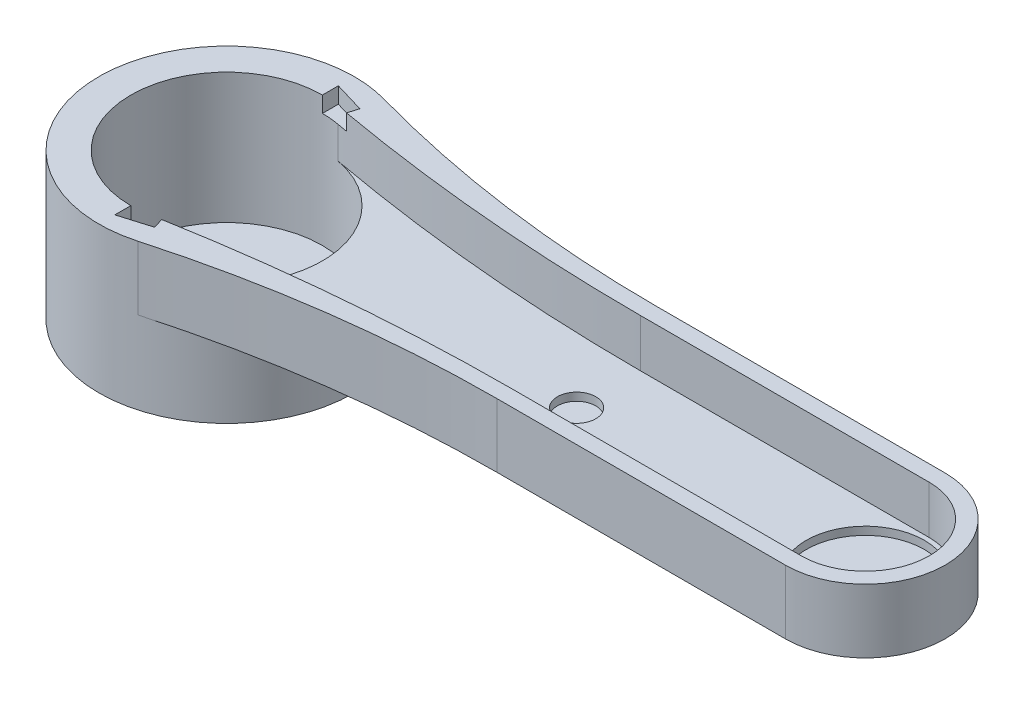
ISO-10303-21;
HEADER;
FILE_DESCRIPTION(('STEP AP214'),'2;1');
FILE_NAME('part.step','',(''),(''),'','','');
FILE_SCHEMA(('AUTOMOTIVE_DESIGN { 1 0 10303 214 1 1 1 1 }'));
ENDSEC;
DATA;
#1=APPLICATION_CONTEXT('core data for automotive mechanical design processes');
#2=APPLICATION_PROTOCOL_DEFINITION('international standard','automotive_design',2000,#1);
#3=PRODUCT_CONTEXT('',#1,'mechanical');
#4=PRODUCT('Part','Part','',(#3));
#5=PRODUCT_RELATED_PRODUCT_CATEGORY('part','',(#4));
#6=PRODUCT_DEFINITION_FORMATION('','',#4);
#7=PRODUCT_DEFINITION_CONTEXT('part definition',#1,'design');
#8=PRODUCT_DEFINITION('design','',#6,#7);
#9=PRODUCT_DEFINITION_SHAPE('','',#8);
#10=(LENGTH_UNIT() NAMED_UNIT(*) SI_UNIT(.MILLI.,.METRE.));
#11=(NAMED_UNIT(*) PLANE_ANGLE_UNIT() SI_UNIT($,.RADIAN.));
#12=(NAMED_UNIT(*) SI_UNIT($,.STERADIAN.) SOLID_ANGLE_UNIT());
#13=UNCERTAINTY_MEASURE_WITH_UNIT(LENGTH_MEASURE(1.E-05),#10,'distance_accuracy_value','');
#14=(GEOMETRIC_REPRESENTATION_CONTEXT(3) GLOBAL_UNCERTAINTY_ASSIGNED_CONTEXT((#13)) GLOBAL_UNIT_ASSIGNED_CONTEXT((#10,
#11,#12)) REPRESENTATION_CONTEXT('',''));
#15=CARTESIAN_POINT('',(0.,0.,0.));
#16=DIRECTION('',(0.,0.,1.));
#17=DIRECTION('',(1.,0.,0.));
#18=AXIS2_PLACEMENT_3D('',#15,#16,#17);
#19=CARTESIAN_POINT('',(0.,15.,0.));
#20=DIRECTION('',(0.,-1.,0.));
#21=DIRECTION('',(0.,0.,-1.));
#22=AXIS2_PLACEMENT_3D('',#19,#20,#21);
#23=CYLINDRICAL_SURFACE('',#22,30.);
#24=CARTESIAN_POINT('',(0.,-25.8,0.));
#25=DIRECTION('',(0.,-1.,0.));
#26=DIRECTION('',(0.,0.,-1.));
#27=AXIS2_PLACEMENT_3D('',#24,#25,#26);
#28=CIRCLE('',#27,30.);
#29=CARTESIAN_POINT('',(0.,-25.8,-30.));
#30=VERTEX_POINT('',#29);
#31=EDGE_CURVE('E281',#30,#30,#28,.T.);
#32=ORIENTED_EDGE('',*,*,#31,.T.);
#33=EDGE_LOOP('',(#32));
#34=FACE_BOUND('',#33,.T.);
#35=CARTESIAN_POINT('',(0.,10.,0.));
#36=DIRECTION('',(0.,1.,0.));
#37=DIRECTION('',(0.,0.,1.));
#38=AXIS2_PLACEMENT_3D('',#35,#36,#37);
#39=CIRCLE('',#38,30.);
#40=CARTESIAN_POINT('',(0.,10.,-30.));
#41=VERTEX_POINT('',#40);
#42=CARTESIAN_POINT('',(5.42925456731082,10.,-29.5046300577271));
#43=VERTEX_POINT('',#42);
#44=EDGE_CURVE('E192',#41,#43,#39,.F.);
#45=ORIENTED_EDGE('',*,*,#44,.F.);
#46=DIRECTION('',(0.,1.,0.));
#47=VECTOR('',#46,1.);
#48=CARTESIAN_POINT('',(0.,10.,-30.));
#49=LINE('',#48,#47);
#50=CARTESIAN_POINT('',(0.,15.,-30.));
#51=VERTEX_POINT('',#50);
#52=EDGE_CURVE('E176',#41,#51,#49,.T.);
#53=ORIENTED_EDGE('',*,*,#52,.T.);
#54=CARTESIAN_POINT('',(0.,15.,0.));
#55=DIRECTION('',(0.,1.,0.));
#56=DIRECTION('',(0.,0.,1.));
#57=AXIS2_PLACEMENT_3D('',#54,#55,#56);
#58=CIRCLE('',#57,30.);
#59=CARTESIAN_POINT('',(0.,15.,30.));
#60=VERTEX_POINT('',#59);
#61=EDGE_CURVE('E312',#51,#60,#58,.T.);
#62=ORIENTED_EDGE('',*,*,#61,.T.);
#63=DIRECTION('',(0.,1.,0.));
#64=VECTOR('',#63,1.);
#65=CARTESIAN_POINT('',(0.,10.,30.));
#66=LINE('',#65,#64);
#67=CARTESIAN_POINT('',(0.,10.,30.));
#68=VERTEX_POINT('',#67);
#69=EDGE_CURVE('E242',#68,#60,#66,.T.);
#70=ORIENTED_EDGE('',*,*,#69,.F.);
#71=CARTESIAN_POINT('',(0.,10.,0.));
#72=DIRECTION('',(0.,1.,0.));
#73=DIRECTION('',(0.,0.,1.));
#74=AXIS2_PLACEMENT_3D('',#71,#72,#73);
#75=CIRCLE('',#74,30.);
#76=CARTESIAN_POINT('',(5.42925456731086,10.,29.5046300577271));
#77=VERTEX_POINT('',#76);
#78=EDGE_CURVE('E228',#77,#68,#75,.F.);
#79=ORIENTED_EDGE('',*,*,#78,.F.);
#80=DIRECTION('',(0.,-1.,0.));
#81=VECTOR('',#80,1.);
#82=CARTESIAN_POINT('',(5.42925456731085,15.,29.5046300577271));
#83=LINE('',#82,#81);
#84=CARTESIAN_POINT('',(5.42925456731085,0.,29.5046300577271));
#85=VERTEX_POINT('',#84);
#86=EDGE_CURVE('E340',#77,#85,#83,.T.);
#87=ORIENTED_EDGE('',*,*,#86,.T.);
#88=CARTESIAN_POINT('',(0.,0.,0.));
#89=DIRECTION('',(0.,-1.,0.));
#90=DIRECTION('',(0.,0.,-1.));
#91=AXIS2_PLACEMENT_3D('',#88,#89,#90);
#92=CIRCLE('',#91,30.);
#93=CARTESIAN_POINT('',(5.42925456731085,0.,-29.5046300577271));
#94=VERTEX_POINT('',#93);
#95=EDGE_CURVE('E284',#94,#85,#92,.T.);
#96=ORIENTED_EDGE('',*,*,#95,.F.);
#97=DIRECTION('',(0.,-1.,0.));
#98=VECTOR('',#97,1.);
#99=CARTESIAN_POINT('',(5.42925456731085,15.,-29.5046300577271));
#100=LINE('',#99,#98);
#101=EDGE_CURVE('E199',#43,#94,#100,.T.);
#102=ORIENTED_EDGE('',*,*,#101,.F.);
#103=EDGE_LOOP('',(#45,#53,#62,#70,#79,#87,#96,#102));
#104=FACE_BOUND('',#103,.T.);
#105=ADVANCED_FACE('F37',(#34,#104),#23,.F.);
#106=CARTESIAN_POINT('',(109.6,15.,-595.608000000001));
#107=DIRECTION('',(0.,-1.,0.));
#108=DIRECTION('',(0.,0.,-1.));
#109=AXIS2_PLACEMENT_3D('',#106,#107,#108);
#110=CYLINDRICAL_SURFACE('',#109,575.608000000001);
#111=CARTESIAN_POINT('',(109.6,15.,-595.608000000001));
#112=DIRECTION('',(0.,1.,0.));
#113=DIRECTION('',(0.,0.,1.));
#114=AXIS2_PLACEMENT_3D('',#111,#112,#113);
#115=CIRCLE('',#114,575.608000000001);
#116=CARTESIAN_POINT('',(109.6,15.,-20.));
#117=VERTEX_POINT('',#116);
#118=CARTESIAN_POINT('',(8.62408159084349,15.,-28.9260490209456));
#119=VERTEX_POINT('',#118);
#120=EDGE_CURVE('E314',#117,#119,#115,.F.);
#121=ORIENTED_EDGE('',*,*,#120,.T.);
#122=DIRECTION('',(0.,1.,0.));
#123=VECTOR('',#122,1.);
#124=CARTESIAN_POINT('',(8.62408159084346,10.,-28.9260490209455));
#125=LINE('',#124,#123);
#126=CARTESIAN_POINT('',(8.62408159084346,10.,-28.9260490209455));
#127=VERTEX_POINT('',#126);
#128=EDGE_CURVE('E54',#127,#119,#125,.T.);
#129=ORIENTED_EDGE('',*,*,#128,.F.);
#130=CARTESIAN_POINT('',(109.6,10.,-595.608000000001));
#131=DIRECTION('',(0.,1.,0.));
#132=DIRECTION('',(0.,0.,1.));
#133=AXIS2_PLACEMENT_3D('',#130,#131,#132);
#134=CIRCLE('',#133,575.608000000001);
#135=EDGE_CURVE('E200',#43,#127,#134,.T.);
#136=ORIENTED_EDGE('',*,*,#135,.F.);
#137=ORIENTED_EDGE('',*,*,#101,.T.);
#138=CARTESIAN_POINT('',(109.6,0.,-595.608000000001));
#139=DIRECTION('',(0.,1.,0.));
#140=DIRECTION('',(0.,0.,1.));
#141=AXIS2_PLACEMENT_3D('',#138,#139,#140);
#142=CIRCLE('',#141,575.608000000001);
#143=CARTESIAN_POINT('',(109.6,0.,-20.));
#144=VERTEX_POINT('',#143);
#145=EDGE_CURVE('E329',#144,#94,#142,.F.);
#146=ORIENTED_EDGE('',*,*,#145,.F.);
#147=DIRECTION('',(0.,-1.,0.));
#148=VECTOR('',#147,1.);
#149=CARTESIAN_POINT('',(109.6,15.,-20.));
#150=LINE('',#149,#148);
#151=EDGE_CURVE('E336',#117,#144,#150,.T.);
#152=ORIENTED_EDGE('',*,*,#151,.F.);
#153=EDGE_LOOP('',(#121,#129,#136,#137,#146,#152));
#154=FACE_BOUND('',#153,.T.);
#155=ADVANCED_FACE('F405',(#154),#110,.T.);
#156=CARTESIAN_POINT('',(0.,15.,0.));
#157=DIRECTION('',(0.,1.,0.));
#158=DIRECTION('',(0.,0.,1.));
#159=AXIS2_PLACEMENT_3D('',#156,#157,#158);
#160=PLANE('',#159);
#161=DIRECTION('',(-1.,0.,0.));
#162=VECTOR('',#161,1.);
#163=CARTESIAN_POINT('',(0.,15.,25.));
#164=LINE('',#163,#162);
#165=CARTESIAN_POINT('',(200.,15.,25.));
#166=VERTEX_POINT('',#165);
#167=CARTESIAN_POINT('',(109.6,15.,25.));
#168=VERTEX_POINT('',#167);
#169=EDGE_CURVE('E288',#166,#168,#164,.T.);
#170=ORIENTED_EDGE('',*,*,#169,.F.);
#171=CARTESIAN_POINT('',(200.,15.,0.));
#172=DIRECTION('',(0.,1.,0.));
#173=DIRECTION('',(0.,0.,1.));
#174=AXIS2_PLACEMENT_3D('',#171,#172,#173);
#175=CIRCLE('',#174,25.);
#176=CARTESIAN_POINT('',(200.,15.,-25.));
#177=VERTEX_POINT('',#176);
#178=EDGE_CURVE('E291',#166,#177,#175,.T.);
#179=ORIENTED_EDGE('',*,*,#178,.T.);
#180=DIRECTION('',(-1.,0.,0.));
#181=VECTOR('',#180,1.);
#182=CARTESIAN_POINT('',(0.,15.,-25.));
#183=LINE('',#182,#181);
#184=CARTESIAN_POINT('',(109.6,15.,-25.));
#185=VERTEX_POINT('',#184);
#186=EDGE_CURVE('E294',#177,#185,#183,.T.);
#187=ORIENTED_EDGE('',*,*,#186,.T.);
#188=CARTESIAN_POINT('',(109.6,15.,-392.905333333334));
#189=DIRECTION('',(0.,1.,0.));
#190=DIRECTION('',(0.,0.,1.));
#191=AXIS2_PLACEMENT_3D('',#188,#189,#190);
#192=CIRCLE('',#191,367.905333333334);
#193=CARTESIAN_POINT('',(10.7475917614871,15.,-38.5290704705994));
#194=VERTEX_POINT('',#193);
#195=EDGE_CURVE('E296',#185,#194,#192,.F.);
#196=ORIENTED_EDGE('',*,*,#195,.T.);
#197=CARTESIAN_POINT('',(0.,15.,0.));
#198=DIRECTION('',(0.,1.,0.));
#199=DIRECTION('',(0.,0.,1.));
#200=AXIS2_PLACEMENT_3D('',#197,#198,#199);
#201=CIRCLE('',#200,40.);
#202=CARTESIAN_POINT('',(10.7475917614871,15.,38.5290704705994));
#203=VERTEX_POINT('',#202);
#204=EDGE_CURVE('E298',#194,#203,#201,.T.);
#205=ORIENTED_EDGE('',*,*,#204,.T.);
#206=CARTESIAN_POINT('',(109.6,15.,392.905333333334));
#207=DIRECTION('',(0.,1.,0.));
#208=DIRECTION('',(0.,0.,1.));
#209=AXIS2_PLACEMENT_3D('',#206,#207,#208);
#210=CIRCLE('',#209,367.905333333334);
#211=EDGE_CURVE('E300',#168,#203,#210,.T.);
#212=ORIENTED_EDGE('',*,*,#211,.F.);
#213=EDGE_LOOP('',(#170,#179,#187,#196,#205,#212));
#214=FACE_BOUND('',#213,.T.);
#215=ORIENTED_EDGE('',*,*,#61,.F.);
#216=DIRECTION('',(0.,0.,-1.));
#217=VECTOR('',#216,1.);
#218=CARTESIAN_POINT('',(0.,15.,0.));
#219=LINE('',#218,#217);
#220=CARTESIAN_POINT('',(0.,15.,-35.));
#221=VERTEX_POINT('',#220);
#222=EDGE_CURVE('E183',#51,#221,#219,.T.);
#223=ORIENTED_EDGE('',*,*,#222,.T.);
#224=DIRECTION('',(0.95831484749991,0.,0.285714285714285));
#225=VECTOR('',#224,1.);
#226=CARTESIAN_POINT('',(9.58314847499908,15.,-32.1428571428571));
#227=LINE('',#226,#225);
#228=CARTESIAN_POINT('',(9.5831484749991,15.,-32.1428571428571));
#229=VERTEX_POINT('',#228);
#230=EDGE_CURVE('E195',#221,#229,#227,.T.);
#231=ORIENTED_EDGE('',*,*,#230,.T.);
#232=DIRECTION('',(-0.285714285714285,0.,0.95831484749991));
#233=VECTOR('',#232,1.);
#234=CARTESIAN_POINT('',(0.,15.,0.));
#235=LINE('',#234,#233);
#236=EDGE_CURVE('E209',#229,#119,#235,.T.);
#237=ORIENTED_EDGE('',*,*,#236,.T.);
#238=ORIENTED_EDGE('',*,*,#120,.F.);
#239=DIRECTION('',(-1.,0.,0.));
#240=VECTOR('',#239,1.);
#241=CARTESIAN_POINT('',(0.,15.,-20.));
#242=LINE('',#241,#240);
#243=CARTESIAN_POINT('',(200.,15.,-20.));
#244=VERTEX_POINT('',#243);
#245=EDGE_CURVE('E317',#244,#117,#242,.T.);
#246=ORIENTED_EDGE('',*,*,#245,.F.);
#247=CARTESIAN_POINT('',(200.,15.,0.));
#248=DIRECTION('',(0.,1.,0.));
#249=DIRECTION('',(0.,0.,1.));
#250=AXIS2_PLACEMENT_3D('',#247,#248,#249);
#251=CIRCLE('',#250,20.);
#252=CARTESIAN_POINT('',(200.,15.,20.));
#253=VERTEX_POINT('',#252);
#254=EDGE_CURVE('E303',#253,#244,#251,.T.);
#255=ORIENTED_EDGE('',*,*,#254,.F.);
#256=DIRECTION('',(-1.,0.,0.));
#257=VECTOR('',#256,1.);
#258=CARTESIAN_POINT('',(0.,15.,20.));
#259=LINE('',#258,#257);
#260=CARTESIAN_POINT('',(109.6,15.,20.));
#261=VERTEX_POINT('',#260);
#262=EDGE_CURVE('E306',#253,#261,#259,.T.);
#263=ORIENTED_EDGE('',*,*,#262,.T.);
#264=CARTESIAN_POINT('',(109.6,15.,595.608000000001));
#265=DIRECTION('',(0.,1.,0.));
#266=DIRECTION('',(0.,0.,1.));
#267=AXIS2_PLACEMENT_3D('',#264,#265,#266);
#268=CIRCLE('',#267,575.608000000001);
#269=CARTESIAN_POINT('',(8.62408159084346,15.,28.9260490209455));
#270=VERTEX_POINT('',#269);
#271=EDGE_CURVE('E309',#261,#270,#268,.T.);
#272=ORIENTED_EDGE('',*,*,#271,.T.);
#273=DIRECTION('',(-0.285714285714285,0.,-0.95831484749991));
#274=VECTOR('',#273,1.);
#275=CARTESIAN_POINT('',(0.,15.,0.));
#276=LINE('',#275,#274);
#277=CARTESIAN_POINT('',(9.58314847499909,15.,32.1428571428571));
#278=VERTEX_POINT('',#277);
#279=EDGE_CURVE('E235',#278,#270,#276,.T.);
#280=ORIENTED_EDGE('',*,*,#279,.F.);
#281=DIRECTION('',(0.95831484749991,0.,-0.285714285714285));
#282=VECTOR('',#281,1.);
#283=CARTESIAN_POINT('',(9.58314847499908,15.,32.1428571428571));
#284=LINE('',#283,#282);
#285=CARTESIAN_POINT('',(0.,15.,35.));
#286=VERTEX_POINT('',#285);
#287=EDGE_CURVE('E62',#286,#278,#284,.T.);
#288=ORIENTED_EDGE('',*,*,#287,.F.);
#289=DIRECTION('',(0.,0.,1.));
#290=VECTOR('',#289,1.);
#291=CARTESIAN_POINT('',(0.,15.,0.));
#292=LINE('',#291,#290);
#293=EDGE_CURVE('E223',#60,#286,#292,.T.);
#294=ORIENTED_EDGE('',*,*,#293,.F.);
#295=EDGE_LOOP('',(#215,#223,#231,#237,#238,#246,#255,#263,#272,#280,#288,#294));
#296=FACE_BOUND('',#295,.T.);
#297=ADVANCED_FACE('F411',(#214,#296),#160,.T.);
#298=CARTESIAN_POINT('',(200.,-5.,0.));
#299=DIRECTION('',(0.,1.,0.));
#300=DIRECTION('',(0.,0.,1.));
#301=AXIS2_PLACEMENT_3D('',#298,#299,#300);
#302=CYLINDRICAL_SURFACE('',#301,18.5);
#303=CARTESIAN_POINT('',(200.,0.,0.));
#304=DIRECTION('',(0.,-1.,0.));
#305=DIRECTION('',(0.,0.,-1.));
#306=AXIS2_PLACEMENT_3D('',#303,#304,#305);
#307=CIRCLE('',#306,18.5);
#308=CARTESIAN_POINT('',(200.,0.,-18.5));
#309=VERTEX_POINT('',#308);
#310=EDGE_CURVE('E259',#309,#309,#307,.T.);
#311=ORIENTED_EDGE('',*,*,#310,.F.);
#312=EDGE_LOOP('',(#311));
#313=FACE_BOUND('',#312,.T.);
#314=CARTESIAN_POINT('',(200.,-2.5,0.));
#315=DIRECTION('',(0.,-1.,0.));
#316=DIRECTION('',(0.,0.,-1.));
#317=AXIS2_PLACEMENT_3D('',#314,#315,#316);
#318=CIRCLE('',#317,18.5);
#319=CARTESIAN_POINT('',(200.,-2.5,-18.5));
#320=VERTEX_POINT('',#319);
#321=EDGE_CURVE('E241',#320,#320,#318,.T.);
#322=ORIENTED_EDGE('',*,*,#321,.T.);
#323=EDGE_LOOP('',(#322));
#324=FACE_BOUND('',#323,.T.);
#325=ADVANCED_FACE('F431',(#313,#324),#302,.F.);
#326=CARTESIAN_POINT('',(109.6,-5.,0.));
#327=DIRECTION('',(0.,1.,0.));
#328=DIRECTION('',(0.,0.,1.));
#329=AXIS2_PLACEMENT_3D('',#326,#327,#328);
#330=CYLINDRICAL_SURFACE('',#329,6.);
#331=CARTESIAN_POINT('',(109.6,0.,0.));
#332=DIRECTION('',(0.,-1.,0.));
#333=DIRECTION('',(0.,0.,-1.));
#334=AXIS2_PLACEMENT_3D('',#331,#332,#333);
#335=CIRCLE('',#334,6.);
#336=CARTESIAN_POINT('',(109.6,0.,-6.));
#337=VERTEX_POINT('',#336);
#338=EDGE_CURVE('E254',#337,#337,#335,.T.);
#339=ORIENTED_EDGE('',*,*,#338,.F.);
#340=EDGE_LOOP('',(#339));
#341=FACE_BOUND('',#340,.T.);
#342=CARTESIAN_POINT('',(109.6,-2.5,0.));
#343=DIRECTION('',(0.,-1.,0.));
#344=DIRECTION('',(0.,0.,-1.));
#345=AXIS2_PLACEMENT_3D('',#342,#343,#344);
#346=CIRCLE('',#345,6.);
#347=CARTESIAN_POINT('',(109.6,-2.5,-6.));
#348=VERTEX_POINT('',#347);
#349=EDGE_CURVE('E251',#348,#348,#346,.T.);
#350=ORIENTED_EDGE('',*,*,#349,.T.);
#351=EDGE_LOOP('',(#350));
#352=FACE_BOUND('',#351,.T.);
#353=ADVANCED_FACE('F426',(#341,#352),#330,.F.);
#354=CARTESIAN_POINT('',(200.,15.,0.));
#355=DIRECTION('',(0.,-1.,0.));
#356=DIRECTION('',(0.,0.,-1.));
#357=AXIS2_PLACEMENT_3D('',#354,#355,#356);
#358=CYLINDRICAL_SURFACE('',#357,20.);
#359=CARTESIAN_POINT('',(200.,0.,0.));
#360=DIRECTION('',(0.,1.,0.));
#361=DIRECTION('',(0.,0.,1.));
#362=AXIS2_PLACEMENT_3D('',#359,#360,#361);
#363=CIRCLE('',#362,20.);
#364=CARTESIAN_POINT('',(200.,0.,20.));
#365=VERTEX_POINT('',#364);
#366=CARTESIAN_POINT('',(200.,0.,-20.));
#367=VERTEX_POINT('',#366);
#368=EDGE_CURVE('E287',#365,#367,#363,.T.);
#369=ORIENTED_EDGE('',*,*,#368,.F.);
#370=DIRECTION('',(0.,-1.,0.));
#371=VECTOR('',#370,1.);
#372=CARTESIAN_POINT('',(200.,15.,20.));
#373=LINE('',#372,#371);
#374=EDGE_CURVE('E11',#253,#365,#373,.T.);
#375=ORIENTED_EDGE('',*,*,#374,.F.);
#376=ORIENTED_EDGE('',*,*,#254,.T.);
#377=DIRECTION('',(0.,-1.,0.));
#378=VECTOR('',#377,1.);
#379=CARTESIAN_POINT('',(200.,15.,-20.));
#380=LINE('',#379,#378);
#381=EDGE_CURVE('E334',#244,#367,#380,.T.);
#382=ORIENTED_EDGE('',*,*,#381,.T.);
#383=EDGE_LOOP('',(#369,#375,#376,#382));
#384=FACE_BOUND('',#383,.T.);
#385=ADVANCED_FACE('F423',(#384),#358,.F.);
#386=CARTESIAN_POINT('',(0.,15.,20.));
#387=DIRECTION('',(0.,0.,1.));
#388=DIRECTION('',(1.,0.,0.));
#389=AXIS2_PLACEMENT_3D('',#386,#387,#388);
#390=PLANE('',#389);
#391=DIRECTION('',(-1.,0.,0.));
#392=VECTOR('',#391,1.);
#393=CARTESIAN_POINT('',(0.,0.,20.));
#394=LINE('',#393,#392);
#395=CARTESIAN_POINT('',(109.6,0.,20.));
#396=VERTEX_POINT('',#395);
#397=EDGE_CURVE('E323',#365,#396,#394,.T.);
#398=ORIENTED_EDGE('',*,*,#397,.T.);
#399=DIRECTION('',(0.,-1.,0.));
#400=VECTOR('',#399,1.);
#401=CARTESIAN_POINT('',(109.6,15.,20.));
#402=LINE('',#401,#400);
#403=EDGE_CURVE('E46',#261,#396,#402,.T.);
#404=ORIENTED_EDGE('',*,*,#403,.F.);
#405=ORIENTED_EDGE('',*,*,#262,.F.);
#406=ORIENTED_EDGE('',*,*,#374,.T.);
#407=EDGE_LOOP('',(#398,#404,#405,#406));
#408=FACE_BOUND('',#407,.T.);
#409=ADVANCED_FACE('F419',(#408),#390,.F.);
#410=CARTESIAN_POINT('',(109.6,15.,595.608000000001));
#411=DIRECTION('',(0.,-1.,0.));
#412=DIRECTION('',(0.,0.,-1.));
#413=AXIS2_PLACEMENT_3D('',#410,#411,#412);
#414=CYLINDRICAL_SURFACE('',#413,575.608000000001);
#415=CARTESIAN_POINT('',(109.6,10.,595.608000000001));
#416=DIRECTION('',(0.,1.,0.));
#417=DIRECTION('',(0.,0.,1.));
#418=AXIS2_PLACEMENT_3D('',#415,#416,#417);
#419=CIRCLE('',#418,575.608000000001);
#420=CARTESIAN_POINT('',(8.62408159084346,10.,28.9260490209455));
#421=VERTEX_POINT('',#420);
#422=EDGE_CURVE('E226',#421,#77,#419,.T.);
#423=ORIENTED_EDGE('',*,*,#422,.F.);
#424=DIRECTION('',(0.,1.,0.));
#425=VECTOR('',#424,1.);
#426=CARTESIAN_POINT('',(8.62408159084346,10.,28.9260490209455));
#427=LINE('',#426,#425);
#428=EDGE_CURVE('E245',#421,#270,#427,.T.);
#429=ORIENTED_EDGE('',*,*,#428,.T.);
#430=ORIENTED_EDGE('',*,*,#271,.F.);
#431=ORIENTED_EDGE('',*,*,#403,.T.);
#432=CARTESIAN_POINT('',(109.6,0.,595.608000000001));
#433=DIRECTION('',(0.,1.,0.));
#434=DIRECTION('',(0.,0.,1.));
#435=AXIS2_PLACEMENT_3D('',#432,#433,#434);
#436=CIRCLE('',#435,575.608000000001);
#437=EDGE_CURVE('E326',#396,#85,#436,.T.);
#438=ORIENTED_EDGE('',*,*,#437,.T.);
#439=ORIENTED_EDGE('',*,*,#86,.F.);
#440=EDGE_LOOP('',(#423,#429,#430,#431,#438,#439));
#441=FACE_BOUND('',#440,.T.);
#442=ADVANCED_FACE('F416',(#441),#414,.T.);
#443=CARTESIAN_POINT('',(0.,15.,25.));
#444=DIRECTION('',(0.,0.,1.));
#445=DIRECTION('',(1.,0.,0.));
#446=AXIS2_PLACEMENT_3D('',#443,#444,#445);
#447=PLANE('',#446);
#448=DIRECTION('',(0.,-1.,0.));
#449=VECTOR('',#448,1.);
#450=CARTESIAN_POINT('',(109.6,15.,25.));
#451=LINE('',#450,#449);
#452=CARTESIAN_POINT('',(109.6,-5.,25.));
#453=VERTEX_POINT('',#452);
#454=EDGE_CURVE('E320',#168,#453,#451,.T.);
#455=ORIENTED_EDGE('',*,*,#454,.T.);
#456=DIRECTION('',(-1.,0.,0.));
#457=VECTOR('',#456,1.);
#458=CARTESIAN_POINT('',(0.,-5.,25.));
#459=LINE('',#458,#457);
#460=CARTESIAN_POINT('',(200.,-5.,25.));
#461=VERTEX_POINT('',#460);
#462=EDGE_CURVE('E262',#461,#453,#459,.T.);
#463=ORIENTED_EDGE('',*,*,#462,.F.);
#464=DIRECTION('',(0.,-1.,0.));
#465=VECTOR('',#464,1.);
#466=CARTESIAN_POINT('',(200.,15.,25.));
#467=LINE('',#466,#465);
#468=EDGE_CURVE('E337',#166,#461,#467,.T.);
#469=ORIENTED_EDGE('',*,*,#468,.F.);
#470=ORIENTED_EDGE('',*,*,#169,.T.);
#471=EDGE_LOOP('',(#455,#463,#469,#470));
#472=FACE_BOUND('',#471,.T.);
#473=ADVANCED_FACE('F39',(#472),#447,.T.);
#474=CARTESIAN_POINT('',(200.,15.,0.));
#475=DIRECTION('',(0.,-1.,0.));
#476=DIRECTION('',(0.,0.,-1.));
#477=AXIS2_PLACEMENT_3D('',#474,#475,#476);
#478=CYLINDRICAL_SURFACE('',#477,25.);
#479=ORIENTED_EDGE('',*,*,#468,.T.);
#480=CARTESIAN_POINT('',(200.,-5.,0.));
#481=DIRECTION('',(0.,-1.,0.));
#482=DIRECTION('',(0.,0.,-1.));
#483=AXIS2_PLACEMENT_3D('',#480,#481,#482);
#484=CIRCLE('',#483,25.);
#485=CARTESIAN_POINT('',(200.,-5.,-25.));
#486=VERTEX_POINT('',#485);
#487=EDGE_CURVE('E258',#486,#461,#484,.T.);
#488=ORIENTED_EDGE('',*,*,#487,.F.);
#489=DIRECTION('',(0.,-1.,0.));
#490=VECTOR('',#489,1.);
#491=CARTESIAN_POINT('',(200.,15.,-25.));
#492=LINE('',#491,#490);
#493=EDGE_CURVE('E350',#177,#486,#492,.T.);
#494=ORIENTED_EDGE('',*,*,#493,.F.);
#495=ORIENTED_EDGE('',*,*,#178,.F.);
#496=EDGE_LOOP('',(#479,#488,#494,#495));
#497=FACE_BOUND('',#496,.T.);
#498=ADVANCED_FACE('F674',(#497),#478,.T.);
#499=CARTESIAN_POINT('',(0.,15.,-25.));
#500=DIRECTION('',(0.,0.,1.));
#501=DIRECTION('',(1.,0.,0.));
#502=AXIS2_PLACEMENT_3D('',#499,#500,#501);
#503=PLANE('',#502);
#504=ORIENTED_EDGE('',*,*,#493,.T.);
#505=DIRECTION('',(1.,0.,0.));
#506=VECTOR('',#505,1.);
#507=CARTESIAN_POINT('',(0.,-5.,-25.));
#508=LINE('',#507,#506);
#509=CARTESIAN_POINT('',(109.6,-5.,-25.));
#510=VERTEX_POINT('',#509);
#511=EDGE_CURVE('E255',#510,#486,#508,.T.);
#512=ORIENTED_EDGE('',*,*,#511,.F.);
#513=DIRECTION('',(0.,-1.,0.));
#514=VECTOR('',#513,1.);
#515=CARTESIAN_POINT('',(109.6,15.,-25.));
#516=LINE('',#515,#514);
#517=EDGE_CURVE('E348',#185,#510,#516,.T.);
#518=ORIENTED_EDGE('',*,*,#517,.F.);
#519=ORIENTED_EDGE('',*,*,#186,.F.);
#520=EDGE_LOOP('',(#504,#512,#518,#519));
#521=FACE_BOUND('',#520,.T.);
#522=ADVANCED_FACE('F401',(#521),#503,.F.);
#523=CARTESIAN_POINT('',(109.6,15.,-392.905333333334));
#524=DIRECTION('',(0.,-1.,0.));
#525=DIRECTION('',(0.,0.,-1.));
#526=AXIS2_PLACEMENT_3D('',#523,#524,#525);
#527=CYLINDRICAL_SURFACE('',#526,367.905333333334);
#528=ORIENTED_EDGE('',*,*,#517,.T.);
#529=CARTESIAN_POINT('',(109.6,-5.,-392.905333333334));
#530=DIRECTION('',(0.,-1.,0.));
#531=DIRECTION('',(0.,0.,-1.));
#532=AXIS2_PLACEMENT_3D('',#529,#530,#531);
#533=CIRCLE('',#532,367.905333333334);
#534=CARTESIAN_POINT('',(10.7475917614871,-5.,-38.5290704705994));
#535=VERTEX_POINT('',#534);
#536=EDGE_CURVE('E271',#535,#510,#533,.F.);
#537=ORIENTED_EDGE('',*,*,#536,.F.);
#538=DIRECTION('',(0.,-1.,0.));
#539=VECTOR('',#538,1.);
#540=CARTESIAN_POINT('',(10.7475917614871,15.,-38.5290704705994));
#541=LINE('',#540,#539);
#542=EDGE_CURVE('E346',#194,#535,#541,.T.);
#543=ORIENTED_EDGE('',*,*,#542,.F.);
#544=ORIENTED_EDGE('',*,*,#195,.F.);
#545=EDGE_LOOP('',(#528,#537,#543,#544));
#546=FACE_BOUND('',#545,.T.);
#547=ADVANCED_FACE('F391',(#546),#527,.F.);
#548=CARTESIAN_POINT('',(0.,15.,0.));
#549=DIRECTION('',(0.,-1.,0.));
#550=DIRECTION('',(0.,0.,-1.));
#551=AXIS2_PLACEMENT_3D('',#548,#549,#550);
#552=CYLINDRICAL_SURFACE('',#551,40.);
#553=CARTESIAN_POINT('',(0.,-5.,0.));
#554=DIRECTION('',(0.,-1.,0.));
#555=DIRECTION('',(0.,0.,-1.));
#556=AXIS2_PLACEMENT_3D('',#553,#554,#555);
#557=CIRCLE('',#556,40.);
#558=CARTESIAN_POINT('',(10.7475917614871,-5.,38.5290704705994));
#559=VERTEX_POINT('',#558);
#560=EDGE_CURVE('E268',#535,#559,#557,.T.);
#561=ORIENTED_EDGE('',*,*,#560,.T.);
#562=DIRECTION('',(0.,-1.,0.));
#563=VECTOR('',#562,1.);
#564=CARTESIAN_POINT('',(10.7475917614871,15.,38.5290704705994));
#565=LINE('',#564,#563);
#566=EDGE_CURVE('E344',#203,#559,#565,.T.);
#567=ORIENTED_EDGE('',*,*,#566,.F.);
#568=ORIENTED_EDGE('',*,*,#204,.F.);
#569=ORIENTED_EDGE('',*,*,#542,.T.);
#570=EDGE_LOOP('',(#561,#567,#568,#569));
#571=FACE_BOUND('',#570,.T.);
#572=CARTESIAN_POINT('',(0.,-30.8,0.));
#573=DIRECTION('',(0.,-1.,0.));
#574=DIRECTION('',(0.,0.,-1.));
#575=AXIS2_PLACEMENT_3D('',#572,#573,#574);
#576=CIRCLE('',#575,40.);
#577=CARTESIAN_POINT('',(0.,-30.8,-40.));
#578=VERTEX_POINT('',#577);
#579=EDGE_CURVE('E274',#578,#578,#576,.T.);
#580=ORIENTED_EDGE('',*,*,#579,.F.);
#581=EDGE_LOOP('',(#580));
#582=FACE_BOUND('',#581,.T.);
#583=ADVANCED_FACE('F388',(#571,#582),#552,.T.);
#584=CARTESIAN_POINT('',(109.6,15.,392.905333333334));
#585=DIRECTION('',(0.,-1.,0.));
#586=DIRECTION('',(0.,0.,-1.));
#587=AXIS2_PLACEMENT_3D('',#584,#585,#586);
#588=CYLINDRICAL_SURFACE('',#587,367.905333333334);
#589=ORIENTED_EDGE('',*,*,#566,.T.);
#590=CARTESIAN_POINT('',(109.6,-5.,392.905333333334));
#591=DIRECTION('',(0.,-1.,0.));
#592=DIRECTION('',(0.,0.,-1.));
#593=AXIS2_PLACEMENT_3D('',#590,#591,#592);
#594=CIRCLE('',#593,367.905333333334);
#595=EDGE_CURVE('E265',#453,#559,#594,.F.);
#596=ORIENTED_EDGE('',*,*,#595,.F.);
#597=ORIENTED_EDGE('',*,*,#454,.F.);
#598=ORIENTED_EDGE('',*,*,#211,.T.);
#599=EDGE_LOOP('',(#589,#596,#597,#598));
#600=FACE_BOUND('',#599,.T.);
#601=ADVANCED_FACE('F390',(#600),#588,.F.);
#602=CARTESIAN_POINT('',(0.,15.,-20.));
#603=DIRECTION('',(0.,0.,1.));
#604=DIRECTION('',(1.,0.,0.));
#605=AXIS2_PLACEMENT_3D('',#602,#603,#604);
#606=PLANE('',#605);
#607=DIRECTION('',(-1.,0.,0.));
#608=VECTOR('',#607,1.);
#609=CARTESIAN_POINT('',(0.,0.,-20.));
#610=LINE('',#609,#608);
#611=EDGE_CURVE('E292',#367,#144,#610,.T.);
#612=ORIENTED_EDGE('',*,*,#611,.F.);
#613=ORIENTED_EDGE('',*,*,#381,.F.);
#614=ORIENTED_EDGE('',*,*,#245,.T.);
#615=ORIENTED_EDGE('',*,*,#151,.T.);
#616=EDGE_LOOP('',(#612,#613,#614,#615));
#617=FACE_BOUND('',#616,.T.);
#618=ADVANCED_FACE('F398',(#617),#606,.T.);
#619=CARTESIAN_POINT('',(0.,0.,0.));
#620=DIRECTION('',(0.,-1.,0.));
#621=DIRECTION('',(0.,0.,-1.));
#622=AXIS2_PLACEMENT_3D('',#619,#620,#621);
#623=PLANE('',#622);
#624=ORIENTED_EDGE('',*,*,#95,.T.);
#625=ORIENTED_EDGE('',*,*,#437,.F.);
#626=ORIENTED_EDGE('',*,*,#397,.F.);
#627=ORIENTED_EDGE('',*,*,#368,.T.);
#628=ORIENTED_EDGE('',*,*,#611,.T.);
#629=ORIENTED_EDGE('',*,*,#145,.T.);
#630=EDGE_LOOP('',(#624,#625,#626,#627,#628,#629));
#631=FACE_BOUND('',#630,.T.);
#632=ORIENTED_EDGE('',*,*,#338,.T.);
#633=EDGE_LOOP('',(#632));
#634=FACE_BOUND('',#633,.T.);
#635=ORIENTED_EDGE('',*,*,#310,.T.);
#636=EDGE_LOOP('',(#635));
#637=FACE_BOUND('',#636,.T.);
#638=ADVANCED_FACE('F383',(#631,#634,#637),#623,.F.);
#639=CARTESIAN_POINT('',(0.,-30.8,0.));
#640=DIRECTION('',(0.,-1.,0.));
#641=DIRECTION('',(0.,0.,-1.));
#642=AXIS2_PLACEMENT_3D('',#639,#640,#641);
#643=PLANE('',#642);
#644=CARTESIAN_POINT('',(15.0000000000004,-30.8,4.24488671257339E-13));
#645=DIRECTION('',(0.,-1.,0.));
#646=DIRECTION('',(0.,0.,-1.));
#647=AXIS2_PLACEMENT_3D('',#644,#645,#646);
#648=CIRCLE('',#647,1.50000000000033);
#649=CARTESIAN_POINT('',(15.0000000000004,-30.8,-1.49999999999991));
#650=VERTEX_POINT('',#649);
#651=EDGE_CURVE('E356',#650,#650,#648,.T.);
#652=ORIENTED_EDGE('',*,*,#651,.F.);
#653=EDGE_LOOP('',(#652));
#654=FACE_BOUND('',#653,.T.);
#655=CARTESIAN_POINT('',(8.48977342514678E-13,-30.8,-15.));
#656=DIRECTION('',(0.,-1.,0.));
#657=DIRECTION('',(0.,0.,-1.));
#658=AXIS2_PLACEMENT_3D('',#655,#656,#657);
#659=CIRCLE('',#658,1.50000000000091);
#660=CARTESIAN_POINT('',(8.48977342514678E-13,-30.8,-16.5000000000009));
#661=VERTEX_POINT('',#660);
#662=EDGE_CURVE('E362',#661,#661,#659,.T.);
#663=ORIENTED_EDGE('',*,*,#662,.F.);
#664=EDGE_LOOP('',(#663));
#665=FACE_BOUND('',#664,.T.);
#666=CARTESIAN_POINT('',(-14.9999999999996,-30.8,-4.2632564145606E-13));
#667=DIRECTION('',(0.,-1.,0.));
#668=DIRECTION('',(0.,0.,-1.));
#669=AXIS2_PLACEMENT_3D('',#666,#667,#668);
#670=CIRCLE('',#669,1.50000000000068);
#671=CARTESIAN_POINT('',(-14.9999999999996,-30.8,-1.50000000000111));
#672=VERTEX_POINT('',#671);
#673=EDGE_CURVE('E359',#672,#672,#670,.T.);
#674=ORIENTED_EDGE('',*,*,#673,.F.);
#675=EDGE_LOOP('',(#674));
#676=FACE_BOUND('',#675,.T.);
#677=CARTESIAN_POINT('',(0.,-30.8,15.));
#678=DIRECTION('',(0.,-1.,0.));
#679=DIRECTION('',(0.,0.,-1.));
#680=AXIS2_PLACEMENT_3D('',#677,#678,#679);
#681=CIRCLE('',#680,1.5);
#682=CARTESIAN_POINT('',(0.,-30.8,13.5));
#683=VERTEX_POINT('',#682);
#684=EDGE_CURVE('E210',#683,#683,#681,.T.);
#685=ORIENTED_EDGE('',*,*,#684,.F.);
#686=EDGE_LOOP('',(#685));
#687=FACE_BOUND('',#686,.T.);
#688=ORIENTED_EDGE('',*,*,#579,.T.);
#689=EDGE_LOOP('',(#688));
#690=FACE_BOUND('',#689,.T.);
#691=ADVANCED_FACE('F379',(#654,#665,#676,#687,#690),#643,.T.);
#692=CARTESIAN_POINT('',(0.,-25.8,0.));
#693=DIRECTION('',(0.,-1.,0.));
#694=DIRECTION('',(0.,0.,-1.));
#695=AXIS2_PLACEMENT_3D('',#692,#693,#694);
#696=PLANE('',#695);
#697=CARTESIAN_POINT('',(15.0000000000004,-25.8,4.24488671257339E-13));
#698=DIRECTION('',(0.,-1.,0.));
#699=DIRECTION('',(0.,0.,-1.));
#700=AXIS2_PLACEMENT_3D('',#697,#698,#699);
#701=CIRCLE('',#700,1.50000000000033);
#702=CARTESIAN_POINT('',(15.0000000000004,-25.8,-1.49999999999991));
#703=VERTEX_POINT('',#702);
#704=EDGE_CURVE('E41',#703,#703,#701,.T.);
#705=ORIENTED_EDGE('',*,*,#704,.T.);
#706=EDGE_LOOP('',(#705));
#707=FACE_BOUND('',#706,.T.);
#708=CARTESIAN_POINT('',(8.48977342514678E-13,-25.8,-15.));
#709=DIRECTION('',(0.,-1.,0.));
#710=DIRECTION('',(0.,0.,-1.));
#711=AXIS2_PLACEMENT_3D('',#708,#709,#710);
#712=CIRCLE('',#711,1.50000000000091);
#713=CARTESIAN_POINT('',(8.48977342514678E-13,-25.8,-16.5000000000009));
#714=VERTEX_POINT('',#713);
#715=EDGE_CURVE('E360',#714,#714,#712,.T.);
#716=ORIENTED_EDGE('',*,*,#715,.T.);
#717=EDGE_LOOP('',(#716));
#718=FACE_BOUND('',#717,.T.);
#719=CARTESIAN_POINT('',(-14.9999999999996,-25.8,-4.2632564145606E-13));
#720=DIRECTION('',(0.,-1.,0.));
#721=DIRECTION('',(0.,0.,-1.));
#722=AXIS2_PLACEMENT_3D('',#719,#720,#721);
#723=CIRCLE('',#722,1.50000000000068);
#724=CARTESIAN_POINT('',(-14.9999999999996,-25.8,-1.50000000000111));
#725=VERTEX_POINT('',#724);
#726=EDGE_CURVE('E357',#725,#725,#723,.T.);
#727=ORIENTED_EDGE('',*,*,#726,.T.);
#728=EDGE_LOOP('',(#727));
#729=FACE_BOUND('',#728,.T.);
#730=CARTESIAN_POINT('',(0.,-25.8,15.));
#731=DIRECTION('',(0.,-1.,0.));
#732=DIRECTION('',(0.,0.,-1.));
#733=AXIS2_PLACEMENT_3D('',#730,#731,#732);
#734=CIRCLE('',#733,1.5);
#735=CARTESIAN_POINT('',(0.,-25.8,13.5));
#736=VERTEX_POINT('',#735);
#737=EDGE_CURVE('E353',#736,#736,#734,.T.);
#738=ORIENTED_EDGE('',*,*,#737,.T.);
#739=EDGE_LOOP('',(#738));
#740=FACE_BOUND('',#739,.T.);
#741=ORIENTED_EDGE('',*,*,#31,.F.);
#742=EDGE_LOOP('',(#741));
#743=FACE_BOUND('',#742,.T.);
#744=ADVANCED_FACE('F382',(#707,#718,#729,#740,#743),#696,.F.);
#745=CARTESIAN_POINT('',(0.,-5.,0.));
#746=DIRECTION('',(0.,-1.,0.));
#747=DIRECTION('',(0.,0.,-1.));
#748=AXIS2_PLACEMENT_3D('',#745,#746,#747);
#749=PLANE('',#748);
#750=ORIENTED_EDGE('',*,*,#511,.T.);
#751=ORIENTED_EDGE('',*,*,#487,.T.);
#752=ORIENTED_EDGE('',*,*,#462,.T.);
#753=ORIENTED_EDGE('',*,*,#595,.T.);
#754=ORIENTED_EDGE('',*,*,#560,.F.);
#755=ORIENTED_EDGE('',*,*,#536,.T.);
#756=EDGE_LOOP('',(#750,#751,#752,#753,#754,#755));
#757=FACE_BOUND('',#756,.T.);
#758=ADVANCED_FACE('F494',(#757),#749,.T.);
#759=CARTESIAN_POINT('',(109.6,-2.5,0.));
#760=DIRECTION('',(0.,-1.,0.));
#761=DIRECTION('',(0.,0.,-1.));
#762=AXIS2_PLACEMENT_3D('',#759,#760,#761);
#763=PLANE('',#762);
#764=ORIENTED_EDGE('',*,*,#349,.F.);
#765=EDGE_LOOP('',(#764));
#766=FACE_BOUND('',#765,.T.);
#767=ADVANCED_FACE('F490',(#766),#763,.F.);
#768=CARTESIAN_POINT('',(200.,-2.5,0.));
#769=DIRECTION('',(0.,-1.,0.));
#770=DIRECTION('',(0.,0.,-1.));
#771=AXIS2_PLACEMENT_3D('',#768,#769,#770);
#772=PLANE('',#771);
#773=ORIENTED_EDGE('',*,*,#321,.F.);
#774=EDGE_LOOP('',(#773));
#775=FACE_BOUND('',#774,.T.);
#776=ADVANCED_FACE('F487',(#775),#772,.F.);
#777=CARTESIAN_POINT('',(9.58314847499908,10.,32.1428571428571));
#778=DIRECTION('',(0.285714285714285,0.,0.95831484749991));
#779=DIRECTION('',(0.95831484749991,0.,-0.285714285714285));
#780=AXIS2_PLACEMENT_3D('',#777,#778,#779);
#781=PLANE('',#780);
#782=ORIENTED_EDGE('',*,*,#287,.T.);
#783=DIRECTION('',(0.,1.,0.));
#784=VECTOR('',#783,1.);
#785=CARTESIAN_POINT('',(9.5831484749991,10.,32.1428571428571));
#786=LINE('',#785,#784);
#787=CARTESIAN_POINT('',(9.5831484749991,10.,32.1428571428571));
#788=VERTEX_POINT('',#787);
#789=EDGE_CURVE('E233',#788,#278,#786,.T.);
#790=ORIENTED_EDGE('',*,*,#789,.F.);
#791=DIRECTION('',(0.95831484749991,0.,-0.285714285714285));
#792=VECTOR('',#791,1.);
#793=CARTESIAN_POINT('',(9.58314847499908,10.,32.1428571428571));
#794=LINE('',#793,#792);
#795=CARTESIAN_POINT('',(0.,10.,35.));
#796=VERTEX_POINT('',#795);
#797=EDGE_CURVE('E219',#796,#788,#794,.T.);
#798=ORIENTED_EDGE('',*,*,#797,.F.);
#799=DIRECTION('',(0.,1.,0.));
#800=VECTOR('',#799,1.);
#801=CARTESIAN_POINT('',(0.,10.,35.));
#802=LINE('',#801,#800);
#803=EDGE_CURVE('E239',#796,#286,#802,.T.);
#804=ORIENTED_EDGE('',*,*,#803,.T.);
#805=EDGE_LOOP('',(#782,#790,#798,#804));
#806=FACE_BOUND('',#805,.T.);
#807=ADVANCED_FACE('F458',(#806),#781,.F.);
#808=CARTESIAN_POINT('',(0.,10.,0.));
#809=DIRECTION('',(-1.,0.,0.));
#810=DIRECTION('',(0.,0.,1.));
#811=AXIS2_PLACEMENT_3D('',#808,#809,#810);
#812=PLANE('',#811);
#813=ORIENTED_EDGE('',*,*,#293,.T.);
#814=ORIENTED_EDGE('',*,*,#803,.F.);
#815=DIRECTION('',(0.,0.,1.));
#816=VECTOR('',#815,1.);
#817=CARTESIAN_POINT('',(0.,10.,0.));
#818=LINE('',#817,#816);
#819=EDGE_CURVE('E230',#68,#796,#818,.T.);
#820=ORIENTED_EDGE('',*,*,#819,.F.);
#821=ORIENTED_EDGE('',*,*,#69,.T.);
#822=EDGE_LOOP('',(#813,#814,#820,#821));
#823=FACE_BOUND('',#822,.T.);
#824=ADVANCED_FACE('F463',(#823),#812,.F.);
#825=CARTESIAN_POINT('',(0.,10.,0.));
#826=DIRECTION('',(0.95831484749991,0.,-0.285714285714285));
#827=DIRECTION('',(-0.285714285714285,0.,-0.95831484749991));
#828=AXIS2_PLACEMENT_3D('',#825,#826,#827);
#829=PLANE('',#828);
#830=ORIENTED_EDGE('',*,*,#279,.T.);
#831=ORIENTED_EDGE('',*,*,#428,.F.);
#832=DIRECTION('',(-0.285714285714285,0.,-0.95831484749991));
#833=VECTOR('',#832,1.);
#834=CARTESIAN_POINT('',(0.,10.,0.));
#835=LINE('',#834,#833);
#836=EDGE_CURVE('E222',#788,#421,#835,.T.);
#837=ORIENTED_EDGE('',*,*,#836,.F.);
#838=ORIENTED_EDGE('',*,*,#789,.T.);
#839=EDGE_LOOP('',(#830,#831,#837,#838));
#840=FACE_BOUND('',#839,.T.);
#841=ADVANCED_FACE('F455',(#840),#829,.F.);
#842=CARTESIAN_POINT('',(0.,10.,0.));
#843=DIRECTION('',(0.,1.,0.));
#844=DIRECTION('',(0.,0.,1.));
#845=AXIS2_PLACEMENT_3D('',#842,#843,#844);
#846=PLANE('',#845);
#847=ORIENTED_EDGE('',*,*,#797,.T.);
#848=ORIENTED_EDGE('',*,*,#836,.T.);
#849=ORIENTED_EDGE('',*,*,#422,.T.);
#850=ORIENTED_EDGE('',*,*,#78,.T.);
#851=ORIENTED_EDGE('',*,*,#819,.T.);
#852=EDGE_LOOP('',(#847,#848,#849,#850,#851));
#853=FACE_BOUND('',#852,.T.);
#854=ADVANCED_FACE('F461',(#853),#846,.T.);
#855=CARTESIAN_POINT('',(0.,10.,0.));
#856=DIRECTION('',(1.,0.,0.));
#857=DIRECTION('',(0.,0.,-1.));
#858=AXIS2_PLACEMENT_3D('',#855,#856,#857);
#859=PLANE('',#858);
#860=ORIENTED_EDGE('',*,*,#222,.F.);
#861=ORIENTED_EDGE('',*,*,#52,.F.);
#862=DIRECTION('',(0.,0.,-1.));
#863=VECTOR('',#862,1.);
#864=CARTESIAN_POINT('',(0.,10.,0.));
#865=LINE('',#864,#863);
#866=CARTESIAN_POINT('',(0.,10.,-35.));
#867=VERTEX_POINT('',#866);
#868=EDGE_CURVE('E180',#41,#867,#865,.T.);
#869=ORIENTED_EDGE('',*,*,#868,.T.);
#870=DIRECTION('',(0.,1.,0.));
#871=VECTOR('',#870,1.);
#872=CARTESIAN_POINT('',(0.,10.,-35.));
#873=LINE('',#872,#871);
#874=EDGE_CURVE('E214',#867,#221,#873,.T.);
#875=ORIENTED_EDGE('',*,*,#874,.T.);
#876=EDGE_LOOP('',(#860,#861,#869,#875));
#877=FACE_BOUND('',#876,.T.);
#878=ADVANCED_FACE('F178',(#877),#859,.T.);
#879=CARTESIAN_POINT('',(9.58314847499908,10.,-32.1428571428571));
#880=DIRECTION('',(-0.285714285714285,0.,0.95831484749991));
#881=DIRECTION('',(0.95831484749991,0.,0.285714285714285));
#882=AXIS2_PLACEMENT_3D('',#879,#880,#881);
#883=PLANE('',#882);
#884=ORIENTED_EDGE('',*,*,#230,.F.);
#885=ORIENTED_EDGE('',*,*,#874,.F.);
#886=DIRECTION('',(0.95831484749991,0.,0.285714285714285));
#887=VECTOR('',#886,1.);
#888=CARTESIAN_POINT('',(9.58314847499908,10.,-32.1428571428571));
#889=LINE('',#888,#887);
#890=CARTESIAN_POINT('',(9.5831484749991,10.,-32.1428571428571));
#891=VERTEX_POINT('',#890);
#892=EDGE_CURVE('E187',#867,#891,#889,.T.);
#893=ORIENTED_EDGE('',*,*,#892,.T.);
#894=DIRECTION('',(0.,1.,0.));
#895=VECTOR('',#894,1.);
#896=CARTESIAN_POINT('',(9.5831484749991,10.,-32.1428571428571));
#897=LINE('',#896,#895);
#898=EDGE_CURVE('E216',#891,#229,#897,.T.);
#899=ORIENTED_EDGE('',*,*,#898,.T.);
#900=EDGE_LOOP('',(#884,#885,#893,#899));
#901=FACE_BOUND('',#900,.T.);
#902=ADVANCED_FACE('F465',(#901),#883,.T.);
#903=CARTESIAN_POINT('',(0.,10.,0.));
#904=DIRECTION('',(-0.95831484749991,0.,-0.285714285714285));
#905=DIRECTION('',(-0.285714285714285,0.,0.95831484749991));
#906=AXIS2_PLACEMENT_3D('',#903,#904,#905);
#907=PLANE('',#906);
#908=ORIENTED_EDGE('',*,*,#236,.F.);
#909=ORIENTED_EDGE('',*,*,#898,.F.);
#910=DIRECTION('',(-0.285714285714285,0.,0.95831484749991));
#911=VECTOR('',#910,1.);
#912=CARTESIAN_POINT('',(0.,10.,0.));
#913=LINE('',#912,#911);
#914=EDGE_CURVE('E202',#891,#127,#913,.T.);
#915=ORIENTED_EDGE('',*,*,#914,.T.);
#916=ORIENTED_EDGE('',*,*,#128,.T.);
#917=EDGE_LOOP('',(#908,#909,#915,#916));
#918=FACE_BOUND('',#917,.T.);
#919=ADVANCED_FACE('F467',(#918),#907,.T.);
#920=CARTESIAN_POINT('',(0.,10.,0.));
#921=DIRECTION('',(0.,1.,0.));
#922=DIRECTION('',(0.,0.,1.));
#923=AXIS2_PLACEMENT_3D('',#920,#921,#922);
#924=PLANE('',#923);
#925=ORIENTED_EDGE('',*,*,#868,.F.);
#926=ORIENTED_EDGE('',*,*,#44,.T.);
#927=ORIENTED_EDGE('',*,*,#135,.T.);
#928=ORIENTED_EDGE('',*,*,#914,.F.);
#929=ORIENTED_EDGE('',*,*,#892,.F.);
#930=EDGE_LOOP('',(#925,#926,#927,#928,#929));
#931=FACE_BOUND('',#930,.T.);
#932=ADVANCED_FACE('F190',(#931),#924,.T.);
#933=CARTESIAN_POINT('',(0.,15.,15.));
#934=DIRECTION('',(0.,-1.,0.));
#935=DIRECTION('',(0.,0.,-1.));
#936=AXIS2_PLACEMENT_3D('',#933,#934,#935);
#937=CYLINDRICAL_SURFACE('',#936,1.5);
#938=ORIENTED_EDGE('',*,*,#684,.T.);
#939=EDGE_LOOP('',(#938));
#940=FACE_BOUND('',#939,.T.);
#941=ORIENTED_EDGE('',*,*,#737,.F.);
#942=EDGE_LOOP('',(#941));
#943=FACE_BOUND('',#942,.T.);
#944=ADVANCED_FACE('F376',(#940,#943),#937,.F.);
#945=CARTESIAN_POINT('',(-14.9999999999996,15.,-4.2632564145606E-13));
#946=DIRECTION('',(0.,-1.,0.));
#947=DIRECTION('',(0.,0.,-1.));
#948=AXIS2_PLACEMENT_3D('',#945,#946,#947);
#949=CYLINDRICAL_SURFACE('',#948,1.50000000000068);
#950=ORIENTED_EDGE('',*,*,#673,.T.);
#951=EDGE_LOOP('',(#950));
#952=FACE_BOUND('',#951,.T.);
#953=ORIENTED_EDGE('',*,*,#726,.F.);
#954=EDGE_LOOP('',(#953));
#955=FACE_BOUND('',#954,.T.);
#956=ADVANCED_FACE('F584',(#952,#955),#949,.F.);
#957=CARTESIAN_POINT('',(8.48977342514678E-13,15.,-15.));
#958=DIRECTION('',(0.,-1.,0.));
#959=DIRECTION('',(0.,0.,-1.));
#960=AXIS2_PLACEMENT_3D('',#957,#958,#959);
#961=CYLINDRICAL_SURFACE('',#960,1.50000000000091);
#962=ORIENTED_EDGE('',*,*,#662,.T.);
#963=EDGE_LOOP('',(#962));
#964=FACE_BOUND('',#963,.T.);
#965=ORIENTED_EDGE('',*,*,#715,.F.);
#966=EDGE_LOOP('',(#965));
#967=FACE_BOUND('',#966,.T.);
#968=ADVANCED_FACE('F590',(#964,#967),#961,.F.);
#969=CARTESIAN_POINT('',(15.0000000000004,15.,4.24488671257339E-13));
#970=DIRECTION('',(0.,-1.,0.));
#971=DIRECTION('',(0.,0.,-1.));
#972=AXIS2_PLACEMENT_3D('',#969,#970,#971);
#973=CYLINDRICAL_SURFACE('',#972,1.50000000000033);
#974=ORIENTED_EDGE('',*,*,#651,.T.);
#975=EDGE_LOOP('',(#974));
#976=FACE_BOUND('',#975,.T.);
#977=ORIENTED_EDGE('',*,*,#704,.F.);
#978=EDGE_LOOP('',(#977));
#979=FACE_BOUND('',#978,.T.);
#980=ADVANCED_FACE('F597',(#976,#979),#973,.F.);
#981=CLOSED_SHELL('',(#105,#155,#297,#325,#353,#385,#409,#442,#473,#498,#522,#547,#583,#601,
#618,#638,#691,#744,#758,#767,#776,#807,#824,#841,#854,#878,#902,#919,#932,#944,#956,#968,#980));
#982=MANIFOLD_SOLID_BREP('B2',#981);
#983=ADVANCED_BREP_SHAPE_REPRESENTATION('',(#18,#982),#14);
#984=SHAPE_DEFINITION_REPRESENTATION(#9,#983);
ENDSEC;
END-ISO-10303-21;
